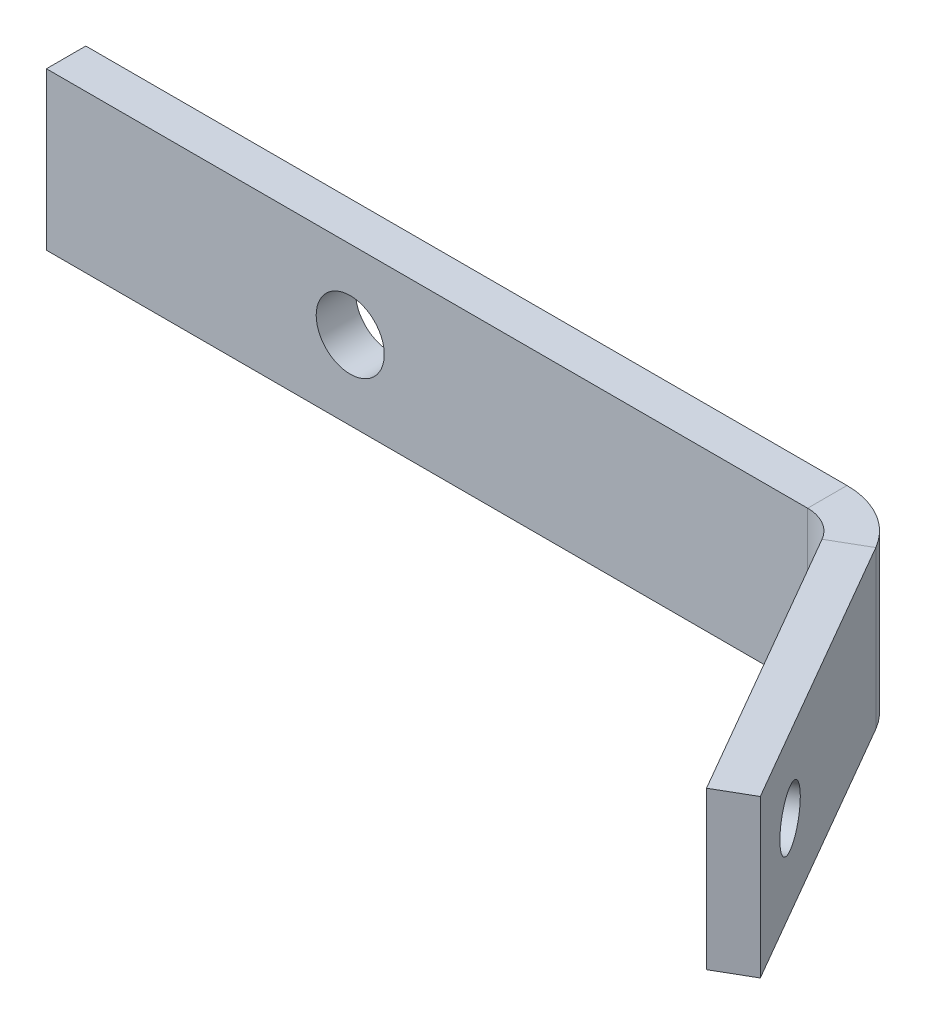
ISO-10303-21;
HEADER;
FILE_DESCRIPTION(('STEP AP214'),'2;1');
FILE_NAME('part.step','',(''),(''),'','','');
FILE_SCHEMA(('AUTOMOTIVE_DESIGN { 1 0 10303 214 1 1 1 1 }'));
ENDSEC;
DATA;
#1=APPLICATION_CONTEXT('core data for automotive mechanical design processes');
#2=APPLICATION_PROTOCOL_DEFINITION('international standard','automotive_design',2000,#1);
#3=PRODUCT_CONTEXT('',#1,'mechanical');
#4=PRODUCT('Part','Part','',(#3));
#5=PRODUCT_RELATED_PRODUCT_CATEGORY('part','',(#4));
#6=PRODUCT_DEFINITION_FORMATION('','',#4);
#7=PRODUCT_DEFINITION_CONTEXT('part definition',#1,'design');
#8=PRODUCT_DEFINITION('design','',#6,#7);
#9=PRODUCT_DEFINITION_SHAPE('','',#8);
#10=(LENGTH_UNIT() NAMED_UNIT(*) SI_UNIT(.MILLI.,.METRE.));
#11=(NAMED_UNIT(*) PLANE_ANGLE_UNIT() SI_UNIT($,.RADIAN.));
#12=(NAMED_UNIT(*) SI_UNIT($,.STERADIAN.) SOLID_ANGLE_UNIT());
#13=UNCERTAINTY_MEASURE_WITH_UNIT(LENGTH_MEASURE(1.E-05),#10,'distance_accuracy_value','');
#14=(GEOMETRIC_REPRESENTATION_CONTEXT(3) GLOBAL_UNCERTAINTY_ASSIGNED_CONTEXT((#13)) GLOBAL_UNIT_ASSIGNED_CONTEXT((#10,
#11,#12)) REPRESENTATION_CONTEXT('',''));
#15=CARTESIAN_POINT('',(0.,0.,0.));
#16=DIRECTION('',(0.,0.,1.));
#17=DIRECTION('',(1.,0.,0.));
#18=AXIS2_PLACEMENT_3D('',#15,#16,#17);
#19=CARTESIAN_POINT('',(8.00761154462872,0.,-16.1614130099692));
#20=DIRECTION('',(0.86602540378444,0.,-0.499999999999998));
#21=DIRECTION('',(-0.499999999999998,0.,-0.86602540378444));
#22=AXIS2_PLACEMENT_3D('',#19,#20,#21);
#23=PLANE('',#22);
#24=CARTESIAN_POINT('',(27.7176115446286,0.330000000000007,17.9773084072134));
#25=DIRECTION('',(0.86602540378444,0.,-0.499999999999998));
#26=DIRECTION('',(-0.499999999999998,0.,-0.86602540378444));
#27=AXIS2_PLACEMENT_3D('',#24,#25,#26);
#28=CIRCLE('',#27,2.25);
#29=CARTESIAN_POINT('',(26.5926115446286,0.330000000000007,16.0287512486984));
#30=VERTEX_POINT('',#29);
#31=EDGE_CURVE('E390',#30,#30,#28,.T.);
#32=ORIENTED_EDGE('',*,*,#31,.T.);
#33=EDGE_LOOP('',(#32));
#34=FACE_BOUND('',#33,.T.);
#35=DIRECTION('',(-0.499999999999998,0.,-0.86602540378444));
#36=VECTOR('',#35,1.);
#37=CARTESIAN_POINT('',(31.0076115446286,6.35000000000001,23.675755564115));
#38=LINE('',#37,#36);
#39=CARTESIAN_POINT('',(31.0076115446286,6.35000000000001,23.675755564115));
#40=VERTEX_POINT('',#39);
#41=CARTESIAN_POINT('',(18.2563946244306,6.35,1.59000000000001));
#42=VERTEX_POINT('',#41);
#43=EDGE_CURVE('E59',#40,#42,#38,.T.);
#44=ORIENTED_EDGE('',*,*,#43,.T.);
#45=DIRECTION('',(0.,-1.,0.));
#46=VECTOR('',#45,1.);
#47=CARTESIAN_POINT('',(18.2563946244306,0.,1.59000000000001));
#48=LINE('',#47,#46);
#49=CARTESIAN_POINT('',(18.2563946244306,-6.35,1.59000000000001));
#50=VERTEX_POINT('',#49);
#51=EDGE_CURVE('E51',#42,#50,#48,.T.);
#52=ORIENTED_EDGE('',*,*,#51,.T.);
#53=DIRECTION('',(0.499999999999998,0.,0.86602540378444));
#54=VECTOR('',#53,1.);
#55=CARTESIAN_POINT('',(31.0076115446286,-6.34999999999999,23.675755564115));
#56=LINE('',#55,#54);
#57=CARTESIAN_POINT('',(31.0076115446286,-6.34999999999999,23.675755564115));
#58=VERTEX_POINT('',#57);
#59=EDGE_CURVE('E67',#50,#58,#56,.T.);
#60=ORIENTED_EDGE('',*,*,#59,.T.);
#61=DIRECTION('',(0.,1.,0.));
#62=VECTOR('',#61,1.);
#63=CARTESIAN_POINT('',(31.0076115446286,6.35000000000001,23.675755564115));
#64=LINE('',#63,#62);
#65=EDGE_CURVE('E158',#58,#40,#64,.T.);
#66=ORIENTED_EDGE('',*,*,#65,.T.);
#67=EDGE_LOOP('',(#44,#52,#60,#66));
#68=FACE_BOUND('',#67,.T.);
#69=ADVANCED_FACE('F42',(#34,#68),#23,.F.);
#70=CARTESIAN_POINT('',(33.7615723286631,6.35000000000001,22.085755564115));
#71=DIRECTION('',(0.,1.,0.));
#72=DIRECTION('',(-0.499999999999998,0.,-0.86602540378444));
#73=AXIS2_PLACEMENT_3D('',#70,#71,#72);
#74=PLANE('',#73);
#75=DIRECTION('',(0.86602540378444,0.,-0.499999999999998));
#76=VECTOR('',#75,1.);
#77=CARTESIAN_POINT('',(21.0103554084651,6.35,0.));
#78=LINE('',#77,#76);
#79=CARTESIAN_POINT('',(21.0103554084651,6.35,0.));
#80=VERTEX_POINT('',#79);
#81=EDGE_CURVE('E12',#42,#80,#78,.T.);
#82=ORIENTED_EDGE('',*,*,#81,.F.);
#83=ORIENTED_EDGE('',*,*,#43,.F.);
#84=DIRECTION('',(-0.86602540378444,0.,0.499999999999998));
#85=VECTOR('',#84,1.);
#86=CARTESIAN_POINT('',(33.7615723286631,6.35000000000001,22.085755564115));
#87=LINE('',#86,#85);
#88=CARTESIAN_POINT('',(33.7615723286631,6.35000000000001,22.085755564115));
#89=VERTEX_POINT('',#88);
#90=EDGE_CURVE('E160',#89,#40,#87,.T.);
#91=ORIENTED_EDGE('',*,*,#90,.F.);
#92=DIRECTION('',(-0.499999999999998,0.,-0.86602540378444));
#93=VECTOR('',#92,1.);
#94=CARTESIAN_POINT('',(33.7615723286631,6.35000000000001,22.085755564115));
#95=LINE('',#94,#93);
#96=EDGE_CURVE('E156',#89,#80,#95,.T.);
#97=ORIENTED_EDGE('',*,*,#96,.T.);
#98=EDGE_LOOP('',(#82,#83,#91,#97));
#99=FACE_BOUND('',#98,.T.);
#100=ADVANCED_FACE('F44',(#99),#74,.T.);
#101=CARTESIAN_POINT('',(33.7615723286631,6.35000000000001,22.085755564115));
#102=DIRECTION('',(0.499999999999998,0.,0.86602540378444));
#103=DIRECTION('',(0.86602540378444,0.,-0.499999999999998));
#104=AXIS2_PLACEMENT_3D('',#101,#102,#103);
#105=PLANE('',#104);
#106=ORIENTED_EDGE('',*,*,#65,.F.);
#107=DIRECTION('',(-0.86602540378444,0.,0.499999999999998));
#108=VECTOR('',#107,1.);
#109=CARTESIAN_POINT('',(33.7615723286631,-6.34999999999999,22.085755564115));
#110=LINE('',#109,#108);
#111=CARTESIAN_POINT('',(33.7615723286631,-6.34999999999999,22.085755564115));
#112=VERTEX_POINT('',#111);
#113=EDGE_CURVE('E162',#112,#58,#110,.T.);
#114=ORIENTED_EDGE('',*,*,#113,.F.);
#115=DIRECTION('',(0.,1.,0.));
#116=VECTOR('',#115,1.);
#117=CARTESIAN_POINT('',(33.7615723286631,6.35000000000001,22.085755564115));
#118=LINE('',#117,#116);
#119=EDGE_CURVE('E153',#112,#89,#118,.T.);
#120=ORIENTED_EDGE('',*,*,#119,.T.);
#121=ORIENTED_EDGE('',*,*,#90,.T.);
#122=EDGE_LOOP('',(#106,#114,#120,#121));
#123=FACE_BOUND('',#122,.T.);
#124=ADVANCED_FACE('F179',(#123),#105,.T.);
#125=CARTESIAN_POINT('',(33.7615723286631,-6.34999999999999,22.085755564115));
#126=DIRECTION('',(0.,-1.,0.));
#127=DIRECTION('',(0.499999999999998,0.,0.86602540378444));
#128=AXIS2_PLACEMENT_3D('',#125,#126,#127);
#129=PLANE('',#128);
#130=DIRECTION('',(-0.86602540378444,0.,0.499999999999998));
#131=VECTOR('',#130,1.);
#132=CARTESIAN_POINT('',(21.0103554084651,-6.35,0.));
#133=LINE('',#132,#131);
#134=CARTESIAN_POINT('',(21.0103554084651,-6.35,0.));
#135=VERTEX_POINT('',#134);
#136=EDGE_CURVE('E165',#135,#50,#133,.T.);
#137=ORIENTED_EDGE('',*,*,#136,.F.);
#138=DIRECTION('',(0.499999999999998,0.,0.86602540378444));
#139=VECTOR('',#138,1.);
#140=CARTESIAN_POINT('',(33.7615723286631,-6.34999999999999,22.085755564115));
#141=LINE('',#140,#139);
#142=EDGE_CURVE('E157',#135,#112,#141,.T.);
#143=ORIENTED_EDGE('',*,*,#142,.T.);
#144=ORIENTED_EDGE('',*,*,#113,.T.);
#145=ORIENTED_EDGE('',*,*,#59,.F.);
#146=EDGE_LOOP('',(#137,#143,#144,#145));
#147=FACE_BOUND('',#146,.T.);
#148=ADVANCED_FACE('F174',(#147),#129,.T.);
#149=CARTESIAN_POINT('',(10.7615723286632,0.,-17.7514130099692));
#150=DIRECTION('',(0.86602540378444,0.,-0.499999999999998));
#151=DIRECTION('',(-0.499999999999998,0.,-0.86602540378444));
#152=AXIS2_PLACEMENT_3D('',#149,#150,#151);
#153=PLANE('',#152);
#154=CARTESIAN_POINT('',(30.4715723286632,0.330000000000007,16.3873084072134));
#155=DIRECTION('',(0.86602540378444,0.,-0.499999999999998));
#156=DIRECTION('',(-0.499999999999998,0.,-0.86602540378444));
#157=AXIS2_PLACEMENT_3D('',#154,#155,#156);
#158=CIRCLE('',#157,2.25);
#159=CARTESIAN_POINT('',(29.3465723286632,0.330000000000007,14.4387512486984));
#160=VERTEX_POINT('',#159);
#161=EDGE_CURVE('E388',#160,#160,#158,.T.);
#162=ORIENTED_EDGE('',*,*,#161,.F.);
#163=EDGE_LOOP('',(#162));
#164=FACE_BOUND('',#163,.T.);
#165=DIRECTION('',(0.,-1.,0.));
#166=VECTOR('',#165,1.);
#167=CARTESIAN_POINT('',(21.0103554084651,0.,0.));
#168=LINE('',#167,#166);
#169=EDGE_CURVE('E131',#80,#135,#168,.T.);
#170=ORIENTED_EDGE('',*,*,#169,.F.);
#171=ORIENTED_EDGE('',*,*,#96,.F.);
#172=ORIENTED_EDGE('',*,*,#119,.F.);
#173=ORIENTED_EDGE('',*,*,#142,.F.);
#174=EDGE_LOOP('',(#170,#171,#172,#173));
#175=FACE_BOUND('',#174,.T.);
#176=ADVANCED_FACE('F181',(#164,#175),#153,.T.);
#177=CARTESIAN_POINT('',(-46.,6.34999999999999,-3.18));
#178=DIRECTION('',(-1.,0.,0.));
#179=DIRECTION('',(0.,0.,1.));
#180=AXIS2_PLACEMENT_3D('',#177,#178,#179);
#181=PLANE('',#180);
#182=DIRECTION('',(0.,-1.,0.));
#183=VECTOR('',#182,1.);
#184=CARTESIAN_POINT('',(-46.,6.34999999999999,0.));
#185=LINE('',#184,#183);
#186=CARTESIAN_POINT('',(-46.,6.34999999999999,0.));
#187=VERTEX_POINT('',#186);
#188=CARTESIAN_POINT('',(-46.,-6.35,0.));
#189=VERTEX_POINT('',#188);
#190=EDGE_CURVE('E204',#187,#189,#185,.T.);
#191=ORIENTED_EDGE('',*,*,#190,.F.);
#192=DIRECTION('',(0.,0.,1.));
#193=VECTOR('',#192,1.);
#194=CARTESIAN_POINT('',(-46.,6.34999999999999,-3.18));
#195=LINE('',#194,#193);
#196=CARTESIAN_POINT('',(-46.,6.34999999999999,-3.18));
#197=VERTEX_POINT('',#196);
#198=EDGE_CURVE('E171',#197,#187,#195,.T.);
#199=ORIENTED_EDGE('',*,*,#198,.F.);
#200=DIRECTION('',(0.,-1.,0.));
#201=VECTOR('',#200,1.);
#202=CARTESIAN_POINT('',(-46.,6.34999999999999,-3.18));
#203=LINE('',#202,#201);
#204=CARTESIAN_POINT('',(-46.,-6.35,-3.18));
#205=VERTEX_POINT('',#204);
#206=EDGE_CURVE('E150',#197,#205,#203,.T.);
#207=ORIENTED_EDGE('',*,*,#206,.T.);
#208=DIRECTION('',(0.,0.,1.));
#209=VECTOR('',#208,1.);
#210=CARTESIAN_POINT('',(-46.,-6.35,-3.18));
#211=LINE('',#210,#209);
#212=EDGE_CURVE('E143',#205,#189,#211,.T.);
#213=ORIENTED_EDGE('',*,*,#212,.T.);
#214=EDGE_LOOP('',(#191,#199,#207,#213));
#215=FACE_BOUND('',#214,.T.);
#216=ADVANCED_FACE('F215',(#215),#181,.T.);
#217=CARTESIAN_POINT('',(0.,0.,-3.18));
#218=DIRECTION('',(0.,0.,-1.));
#219=DIRECTION('',(-1.,0.,0.));
#220=AXIS2_PLACEMENT_3D('',#217,#218,#219);
#221=PLANE('',#220);
#222=CARTESIAN_POINT('',(-21.455259123229,7.52176099183544E-12,-3.18));
#223=DIRECTION('',(0.,0.,-1.));
#224=DIRECTION('',(-1.,0.,0.));
#225=AXIS2_PLACEMENT_3D('',#222,#223,#224);
#226=CIRCLE('',#225,2.75);
#227=CARTESIAN_POINT('',(-24.205259123229,7.52176099183544E-12,-3.18));
#228=VERTEX_POINT('',#227);
#229=EDGE_CURVE('E192',#228,#228,#226,.T.);
#230=ORIENTED_EDGE('',*,*,#229,.F.);
#231=EDGE_LOOP('',(#230));
#232=FACE_BOUND('',#231,.T.);
#233=DIRECTION('',(-1.,0.,0.));
#234=VECTOR('',#233,1.);
#235=CARTESIAN_POINT('',(46.,6.35000000000001,-3.18));
#236=LINE('',#235,#234);
#237=CARTESIAN_POINT('',(15.5024338403961,6.35,-3.18));
#238=VERTEX_POINT('',#237);
#239=EDGE_CURVE('E141',#238,#197,#236,.T.);
#240=ORIENTED_EDGE('',*,*,#239,.F.);
#241=DIRECTION('',(0.,-1.,0.));
#242=VECTOR('',#241,1.);
#243=CARTESIAN_POINT('',(15.5024338403961,0.,-3.18));
#244=LINE('',#243,#242);
#245=CARTESIAN_POINT('',(15.5024338403961,-6.35,-3.18));
#246=VERTEX_POINT('',#245);
#247=EDGE_CURVE('E129',#238,#246,#244,.T.);
#248=ORIENTED_EDGE('',*,*,#247,.T.);
#249=DIRECTION('',(1.,0.,0.));
#250=VECTOR('',#249,1.);
#251=CARTESIAN_POINT('',(46.,-6.34999999999999,-3.18));
#252=LINE('',#251,#250);
#253=EDGE_CURVE('E122',#205,#246,#252,.T.);
#254=ORIENTED_EDGE('',*,*,#253,.F.);
#255=ORIENTED_EDGE('',*,*,#206,.F.);
#256=EDGE_LOOP('',(#240,#248,#254,#255));
#257=FACE_BOUND('',#256,.T.);
#258=ADVANCED_FACE('F138',(#232,#257),#221,.T.);
#259=CARTESIAN_POINT('',(46.,-6.34999999999999,-3.18));
#260=DIRECTION('',(0.,-1.,0.));
#261=DIRECTION('',(1.,0.,0.));
#262=AXIS2_PLACEMENT_3D('',#259,#260,#261);
#263=PLANE('',#262);
#264=ORIENTED_EDGE('',*,*,#253,.T.);
#265=DIRECTION('',(0.,0.,1.));
#266=VECTOR('',#265,1.);
#267=CARTESIAN_POINT('',(15.5024338403961,-6.35,-3.18));
#268=LINE('',#267,#266);
#269=CARTESIAN_POINT('',(15.5024338403961,-6.35,0.));
#270=VERTEX_POINT('',#269);
#271=EDGE_CURVE('E110',#246,#270,#268,.T.);
#272=ORIENTED_EDGE('',*,*,#271,.T.);
#273=DIRECTION('',(1.,0.,0.));
#274=VECTOR('',#273,1.);
#275=CARTESIAN_POINT('',(46.,-6.34999999999999,0.));
#276=LINE('',#275,#274);
#277=EDGE_CURVE('E201',#189,#270,#276,.T.);
#278=ORIENTED_EDGE('',*,*,#277,.F.);
#279=ORIENTED_EDGE('',*,*,#212,.F.);
#280=EDGE_LOOP('',(#264,#272,#278,#279));
#281=FACE_BOUND('',#280,.T.);
#282=ADVANCED_FACE('F145',(#281),#263,.T.);
#283=CARTESIAN_POINT('',(0.,0.,0.));
#284=DIRECTION('',(0.,0.,-1.));
#285=DIRECTION('',(-1.,0.,0.));
#286=AXIS2_PLACEMENT_3D('',#283,#284,#285);
#287=PLANE('',#286);
#288=CARTESIAN_POINT('',(-21.455259123229,7.52176099183544E-12,0.));
#289=DIRECTION('',(0.,0.,-1.));
#290=DIRECTION('',(-1.,0.,0.));
#291=AXIS2_PLACEMENT_3D('',#288,#289,#290);
#292=CIRCLE('',#291,2.75);
#293=CARTESIAN_POINT('',(-24.205259123229,7.52176099183544E-12,0.));
#294=VERTEX_POINT('',#293);
#295=EDGE_CURVE('E46',#294,#294,#292,.T.);
#296=ORIENTED_EDGE('',*,*,#295,.T.);
#297=EDGE_LOOP('',(#296));
#298=FACE_BOUND('',#297,.T.);
#299=DIRECTION('',(0.,-1.,0.));
#300=VECTOR('',#299,1.);
#301=CARTESIAN_POINT('',(15.5024338403961,0.,0.));
#302=LINE('',#301,#300);
#303=CARTESIAN_POINT('',(15.5024338403961,6.35,0.));
#304=VERTEX_POINT('',#303);
#305=EDGE_CURVE('E132',#304,#270,#302,.T.);
#306=ORIENTED_EDGE('',*,*,#305,.F.);
#307=DIRECTION('',(-1.,0.,0.));
#308=VECTOR('',#307,1.);
#309=CARTESIAN_POINT('',(46.,6.35000000000001,0.));
#310=LINE('',#309,#308);
#311=EDGE_CURVE('E121',#304,#187,#310,.T.);
#312=ORIENTED_EDGE('',*,*,#311,.T.);
#313=ORIENTED_EDGE('',*,*,#190,.T.);
#314=ORIENTED_EDGE('',*,*,#277,.T.);
#315=EDGE_LOOP('',(#306,#312,#313,#314));
#316=FACE_BOUND('',#315,.T.);
#317=ADVANCED_FACE('F209',(#298,#316),#287,.F.);
#318=CARTESIAN_POINT('',(46.,6.35000000000001,-3.18));
#319=DIRECTION('',(0.,1.,0.));
#320=DIRECTION('',(-1.,0.,0.));
#321=AXIS2_PLACEMENT_3D('',#318,#319,#320);
#322=PLANE('',#321);
#323=ORIENTED_EDGE('',*,*,#311,.F.);
#324=DIRECTION('',(0.,0.,-1.));
#325=VECTOR('',#324,1.);
#326=CARTESIAN_POINT('',(15.5024338403961,6.35,-3.18));
#327=LINE('',#326,#325);
#328=EDGE_CURVE('E199',#304,#238,#327,.T.);
#329=ORIENTED_EDGE('',*,*,#328,.T.);
#330=ORIENTED_EDGE('',*,*,#239,.T.);
#331=ORIENTED_EDGE('',*,*,#198,.T.);
#332=EDGE_LOOP('',(#323,#329,#330,#331));
#333=FACE_BOUND('',#332,.T.);
#334=ADVANCED_FACE('F213',(#333),#322,.T.);
#335=CARTESIAN_POINT('',(15.5024338403961,6.35,3.18));
#336=DIRECTION('',(0.,1.,0.));
#337=DIRECTION('',(0.,0.,1.));
#338=AXIS2_PLACEMENT_3D('',#335,#336,#337);
#339=PLANE('',#338);
#340=ORIENTED_EDGE('',*,*,#328,.F.);
#341=CARTESIAN_POINT('',(15.5024338403961,6.35,3.18));
#342=DIRECTION('',(0.,-1.,0.));
#343=DIRECTION('',(0.,0.,-1.));
#344=AXIS2_PLACEMENT_3D('',#341,#342,#343);
#345=CIRCLE('',#344,3.18);
#346=EDGE_CURVE('E188',#304,#42,#345,.T.);
#347=ORIENTED_EDGE('',*,*,#346,.T.);
#348=ORIENTED_EDGE('',*,*,#81,.T.);
#349=CARTESIAN_POINT('',(15.5024338403961,6.35,3.18));
#350=DIRECTION('',(0.,-1.,0.));
#351=DIRECTION('',(0.,0.,1.));
#352=AXIS2_PLACEMENT_3D('',#349,#350,#351);
#353=CIRCLE('',#352,6.36);
#354=EDGE_CURVE('E133',#238,#80,#353,.T.);
#355=ORIENTED_EDGE('',*,*,#354,.F.);
#356=EDGE_LOOP('',(#340,#347,#348,#355));
#357=FACE_BOUND('',#356,.T.);
#358=ADVANCED_FACE('F186',(#357),#339,.T.);
#359=CARTESIAN_POINT('',(15.5024338403961,-6.35,3.18));
#360=DIRECTION('',(0.,-1.,0.));
#361=DIRECTION('',(0.,0.,-1.));
#362=AXIS2_PLACEMENT_3D('',#359,#360,#361);
#363=PLANE('',#362);
#364=CARTESIAN_POINT('',(15.5024338403961,-6.35,3.18));
#365=DIRECTION('',(0.,-1.,0.));
#366=DIRECTION('',(0.,0.,-1.));
#367=AXIS2_PLACEMENT_3D('',#364,#365,#366);
#368=CIRCLE('',#367,3.18);
#369=EDGE_CURVE('E116',#50,#270,#368,.F.);
#370=ORIENTED_EDGE('',*,*,#369,.T.);
#371=ORIENTED_EDGE('',*,*,#271,.F.);
#372=CARTESIAN_POINT('',(15.5024338403961,-6.35,3.18));
#373=DIRECTION('',(0.,1.,0.));
#374=DIRECTION('',(0.,0.,-1.));
#375=AXIS2_PLACEMENT_3D('',#372,#373,#374);
#376=CIRCLE('',#375,6.36);
#377=EDGE_CURVE('E114',#135,#246,#376,.T.);
#378=ORIENTED_EDGE('',*,*,#377,.F.);
#379=ORIENTED_EDGE('',*,*,#136,.T.);
#380=EDGE_LOOP('',(#370,#371,#378,#379));
#381=FACE_BOUND('',#380,.T.);
#382=ADVANCED_FACE('F112',(#381),#363,.T.);
#383=CARTESIAN_POINT('',(15.5024338403961,14.0126281220331,3.18));
#384=DIRECTION('',(0.,-1.,0.));
#385=DIRECTION('',(0.,0.,-1.));
#386=AXIS2_PLACEMENT_3D('',#383,#384,#385);
#387=CYLINDRICAL_SURFACE('',#386,6.36);
#388=ORIENTED_EDGE('',*,*,#169,.T.);
#389=ORIENTED_EDGE('',*,*,#377,.T.);
#390=ORIENTED_EDGE('',*,*,#247,.F.);
#391=ORIENTED_EDGE('',*,*,#354,.T.);
#392=EDGE_LOOP('',(#388,#389,#390,#391));
#393=FACE_BOUND('',#392,.T.);
#394=ADVANCED_FACE('F127',(#393),#387,.T.);
#395=CARTESIAN_POINT('',(15.5024338403961,14.0126281220331,3.18));
#396=DIRECTION('',(0.,-1.,0.));
#397=DIRECTION('',(0.,0.,-1.));
#398=AXIS2_PLACEMENT_3D('',#395,#396,#397);
#399=CYLINDRICAL_SURFACE('',#398,3.18);
#400=ORIENTED_EDGE('',*,*,#51,.F.);
#401=ORIENTED_EDGE('',*,*,#346,.F.);
#402=ORIENTED_EDGE('',*,*,#305,.T.);
#403=ORIENTED_EDGE('',*,*,#369,.F.);
#404=EDGE_LOOP('',(#400,#401,#402,#403));
#405=FACE_BOUND('',#404,.T.);
#406=ADVANCED_FACE('F274',(#405),#399,.F.);
#407=CARTESIAN_POINT('',(-21.455259123229,7.52176099183544E-12,6.82));
#408=DIRECTION('',(0.,0.,-1.));
#409=DIRECTION('',(-1.,0.,0.));
#410=AXIS2_PLACEMENT_3D('',#407,#408,#409);
#411=CYLINDRICAL_SURFACE('',#410,2.75);
#412=ORIENTED_EDGE('',*,*,#229,.T.);
#413=EDGE_LOOP('',(#412));
#414=FACE_BOUND('',#413,.T.);
#415=ORIENTED_EDGE('',*,*,#295,.F.);
#416=EDGE_LOOP('',(#415));
#417=FACE_BOUND('',#416,.T.);
#418=ADVANCED_FACE('F281',(#414,#417),#411,.F.);
#419=CARTESIAN_POINT('',(21.8113182908188,0.330000000000007,21.3873084072134));
#420=DIRECTION('',(0.86602540378444,0.,-0.499999999999998));
#421=DIRECTION('',(-0.499999999999998,0.,-0.86602540378444));
#422=AXIS2_PLACEMENT_3D('',#419,#420,#421);
#423=CYLINDRICAL_SURFACE('',#422,2.25);
#424=ORIENTED_EDGE('',*,*,#161,.T.);
#425=EDGE_LOOP('',(#424));
#426=FACE_BOUND('',#425,.T.);
#427=ORIENTED_EDGE('',*,*,#31,.F.);
#428=EDGE_LOOP('',(#427));
#429=FACE_BOUND('',#428,.T.);
#430=ADVANCED_FACE('F288',(#426,#429),#423,.F.);
#431=CLOSED_SHELL('',(#69,#100,#124,#148,#176,#216,#258,#282,#317,#334,#358,#382,#394,#406,#418,#430));
#432=MANIFOLD_SOLID_BREP('B2',#431);
#433=ADVANCED_BREP_SHAPE_REPRESENTATION('',(#18,#432),#14);
#434=SHAPE_DEFINITION_REPRESENTATION(#9,#433);
ENDSEC;
END-ISO-10303-21;
